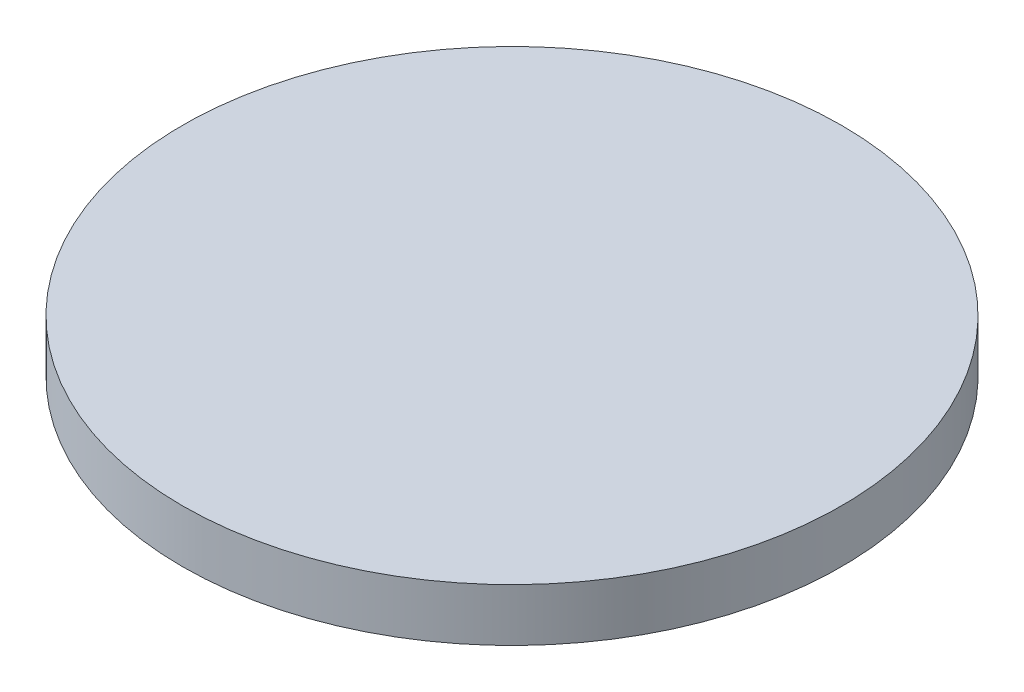
ISO-10303-21;
HEADER;
FILE_DESCRIPTION(('STEP AP214'),'2;1');
FILE_NAME('part.step','',(''),(''),'','','');
FILE_SCHEMA(('AUTOMOTIVE_DESIGN { 1 0 10303 214 1 1 1 1 }'));
ENDSEC;
DATA;
#1=APPLICATION_CONTEXT('core data for automotive mechanical design processes');
#2=APPLICATION_PROTOCOL_DEFINITION('international standard','automotive_design',2000,#1);
#3=PRODUCT_CONTEXT('',#1,'mechanical');
#4=PRODUCT('Part','Part','',(#3));
#5=PRODUCT_RELATED_PRODUCT_CATEGORY('part','',(#4));
#6=PRODUCT_DEFINITION_FORMATION('','',#4);
#7=PRODUCT_DEFINITION_CONTEXT('part definition',#1,'design');
#8=PRODUCT_DEFINITION('design','',#6,#7);
#9=PRODUCT_DEFINITION_SHAPE('','',#8);
#10=(LENGTH_UNIT() NAMED_UNIT(*) SI_UNIT(.MILLI.,.METRE.));
#11=(NAMED_UNIT(*) PLANE_ANGLE_UNIT() SI_UNIT($,.RADIAN.));
#12=(NAMED_UNIT(*) SI_UNIT($,.STERADIAN.) SOLID_ANGLE_UNIT());
#13=UNCERTAINTY_MEASURE_WITH_UNIT(LENGTH_MEASURE(1.E-05),#10,'distance_accuracy_value','');
#14=(GEOMETRIC_REPRESENTATION_CONTEXT(3) GLOBAL_UNCERTAINTY_ASSIGNED_CONTEXT((#13)) GLOBAL_UNIT_ASSIGNED_CONTEXT((#10,
#11,#12)) REPRESENTATION_CONTEXT('',''));
#15=CARTESIAN_POINT('',(0.,0.,0.));
#16=DIRECTION('',(0.,0.,1.));
#17=DIRECTION('',(1.,0.,0.));
#18=AXIS2_PLACEMENT_3D('',#15,#16,#17);
#19=CARTESIAN_POINT('',(0.,4.,0.));
#20=DIRECTION('',(0.,-1.,0.));
#21=DIRECTION('',(0.,0.,-1.));
#22=AXIS2_PLACEMENT_3D('',#19,#20,#21);
#23=CYLINDRICAL_SURFACE('',#22,25.);
#24=CARTESIAN_POINT('',(0.,4.,0.));
#25=DIRECTION('',(0.,1.,0.));
#26=DIRECTION('',(0.,0.,1.));
#27=AXIS2_PLACEMENT_3D('',#24,#25,#26);
#28=CIRCLE('',#27,25.);
#29=CARTESIAN_POINT('',(0.,4.,25.));
#30=VERTEX_POINT('',#29);
#31=EDGE_CURVE('E10',#30,#30,#28,.T.);
#32=ORIENTED_EDGE('',*,*,#31,.F.);
#33=EDGE_LOOP('',(#32));
#34=FACE_BOUND('',#33,.T.);
#35=CARTESIAN_POINT('',(0.,0.,0.));
#36=DIRECTION('',(0.,1.,0.));
#37=DIRECTION('',(0.,0.,1.));
#38=AXIS2_PLACEMENT_3D('',#35,#36,#37);
#39=CIRCLE('',#38,25.);
#40=CARTESIAN_POINT('',(0.,0.,25.));
#41=VERTEX_POINT('',#40);
#42=EDGE_CURVE('E34',#41,#41,#39,.T.);
#43=ORIENTED_EDGE('',*,*,#42,.T.);
#44=EDGE_LOOP('',(#43));
#45=FACE_BOUND('',#44,.T.);
#46=ADVANCED_FACE('F31',(#34,#45),#23,.T.);
#47=CARTESIAN_POINT('',(0.,4.,0.));
#48=DIRECTION('',(0.,1.,0.));
#49=DIRECTION('',(0.,0.,1.));
#50=AXIS2_PLACEMENT_3D('',#47,#48,#49);
#51=PLANE('',#50);
#52=ORIENTED_EDGE('',*,*,#31,.T.);
#53=EDGE_LOOP('',(#52));
#54=FACE_BOUND('',#53,.T.);
#55=ADVANCED_FACE('F46',(#54),#51,.T.);
#56=CARTESIAN_POINT('',(0.,0.,0.));
#57=DIRECTION('',(0.,1.,0.));
#58=DIRECTION('',(0.,0.,1.));
#59=AXIS2_PLACEMENT_3D('',#56,#57,#58);
#60=PLANE('',#59);
#61=ORIENTED_EDGE('',*,*,#42,.F.);
#62=EDGE_LOOP('',(#61));
#63=FACE_BOUND('',#62,.T.);
#64=ADVANCED_FACE('F44',(#63),#60,.F.);
#65=CLOSED_SHELL('',(#46,#55,#64));
#66=MANIFOLD_SOLID_BREP('B2',#65);
#67=ADVANCED_BREP_SHAPE_REPRESENTATION('',(#18,#66),#14);
#68=SHAPE_DEFINITION_REPRESENTATION(#9,#67);
ENDSEC;
END-ISO-10303-21;
